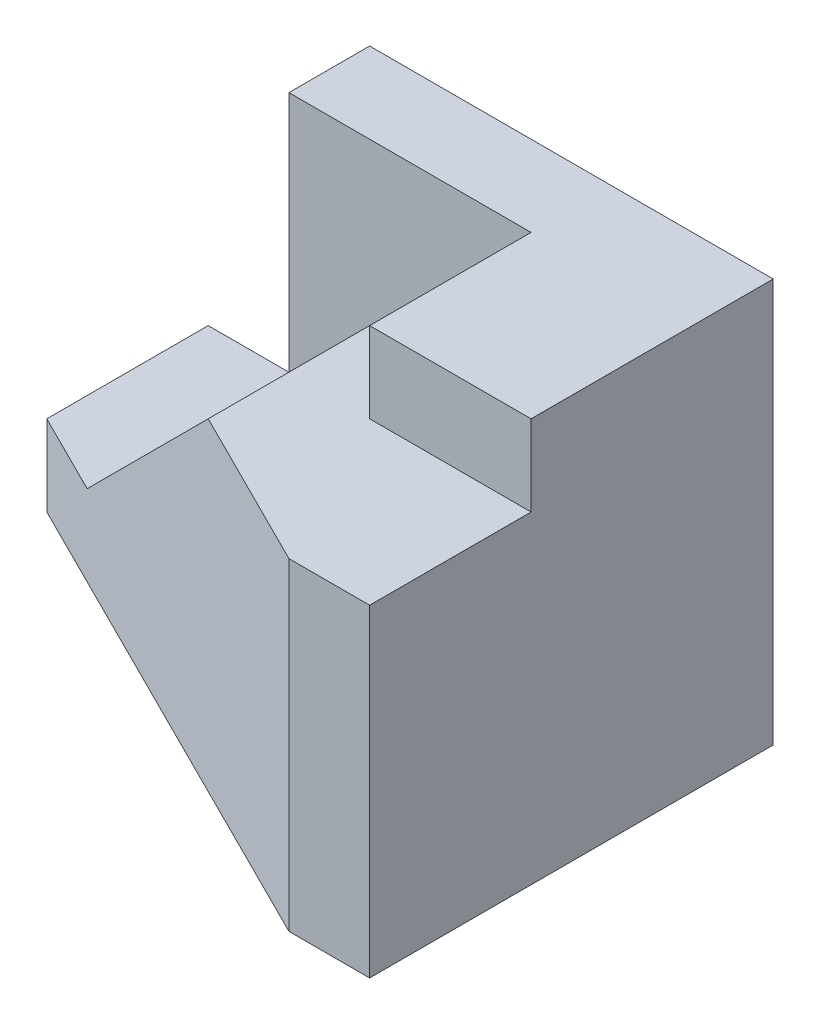
ISO-10303-21;
HEADER;
FILE_DESCRIPTION(('STEP AP214'),'2;1');
FILE_NAME('part.step','',(''),(''),'','','');
FILE_SCHEMA(('AUTOMOTIVE_DESIGN { 1 0 10303 214 1 1 1 1 }'));
ENDSEC;
DATA;
#1=APPLICATION_CONTEXT('core data for automotive mechanical design processes');
#2=APPLICATION_PROTOCOL_DEFINITION('international standard','automotive_design',2000,#1);
#3=PRODUCT_CONTEXT('',#1,'mechanical');
#4=PRODUCT('Part','Part','',(#3));
#5=PRODUCT_RELATED_PRODUCT_CATEGORY('part','',(#4));
#6=PRODUCT_DEFINITION_FORMATION('','',#4);
#7=PRODUCT_DEFINITION_CONTEXT('part definition',#1,'design');
#8=PRODUCT_DEFINITION('design','',#6,#7);
#9=PRODUCT_DEFINITION_SHAPE('','',#8);
#10=(LENGTH_UNIT() NAMED_UNIT(*) SI_UNIT(.MILLI.,.METRE.));
#11=(NAMED_UNIT(*) PLANE_ANGLE_UNIT() SI_UNIT($,.RADIAN.));
#12=(NAMED_UNIT(*) SI_UNIT($,.STERADIAN.) SOLID_ANGLE_UNIT());
#13=UNCERTAINTY_MEASURE_WITH_UNIT(LENGTH_MEASURE(1.E-05),#10,'distance_accuracy_value','');
#14=(GEOMETRIC_REPRESENTATION_CONTEXT(3) GLOBAL_UNCERTAINTY_ASSIGNED_CONTEXT((#13)) GLOBAL_UNIT_ASSIGNED_CONTEXT((#10,
#11,#12)) REPRESENTATION_CONTEXT('',''));
#15=CARTESIAN_POINT('',(0.,0.,0.));
#16=DIRECTION('',(0.,0.,1.));
#17=DIRECTION('',(1.,0.,0.));
#18=AXIS2_PLACEMENT_3D('',#15,#16,#17);
#19=CARTESIAN_POINT('',(20.,20.,0.));
#20=DIRECTION('',(1.,0.,0.));
#21=DIRECTION('',(0.,0.,-1.));
#22=AXIS2_PLACEMENT_3D('',#19,#20,#21);
#23=PLANE('',#22);
#24=DIRECTION('',(0.,0.,1.));
#25=VECTOR('',#24,1.);
#26=CARTESIAN_POINT('',(20.,20.,0.));
#27=LINE('',#26,#25);
#28=CARTESIAN_POINT('',(20.,20.,0.));
#29=VERTEX_POINT('',#28);
#30=CARTESIAN_POINT('',(20.,20.,10.));
#31=VERTEX_POINT('',#30);
#32=EDGE_CURVE('E134',#29,#31,#27,.T.);
#33=ORIENTED_EDGE('',*,*,#32,.T.);
#34=DIRECTION('',(0.,1.,0.));
#35=VECTOR('',#34,1.);
#36=CARTESIAN_POINT('',(20.,40.,10.));
#37=LINE('',#36,#35);
#38=CARTESIAN_POINT('',(20.,50.,10.));
#39=VERTEX_POINT('',#38);
#40=EDGE_CURVE('E121',#31,#39,#37,.T.);
#41=ORIENTED_EDGE('',*,*,#40,.T.);
#42=DIRECTION('',(0.,0.,1.));
#43=VECTOR('',#42,1.);
#44=CARTESIAN_POINT('',(20.,50.,0.));
#45=LINE('',#44,#43);
#46=CARTESIAN_POINT('',(20.,50.,0.));
#47=VERTEX_POINT('',#46);
#48=EDGE_CURVE('E142',#47,#39,#45,.T.);
#49=ORIENTED_EDGE('',*,*,#48,.F.);
#50=DIRECTION('',(0.,1.,0.));
#51=VECTOR('',#50,1.);
#52=CARTESIAN_POINT('',(20.,20.,0.));
#53=LINE('',#52,#51);
#54=EDGE_CURVE('E140',#29,#47,#53,.T.);
#55=ORIENTED_EDGE('',*,*,#54,.F.);
#56=EDGE_LOOP('',(#33,#41,#49,#55));
#57=FACE_BOUND('',#56,.T.);
#58=ADVANCED_FACE('F33',(#57),#23,.F.);
#59=CARTESIAN_POINT('',(0.,0.,50.));
#60=DIRECTION('',(1.,0.,0.));
#61=DIRECTION('',(0.,0.,-1.));
#62=AXIS2_PLACEMENT_3D('',#59,#60,#61);
#63=PLANE('',#62);
#64=DIRECTION('',(0.,0.,-1.));
#65=VECTOR('',#64,1.);
#66=CARTESIAN_POINT('',(0.,0.,50.));
#67=LINE('',#66,#65);
#68=CARTESIAN_POINT('',(0.,0.,20.));
#69=VERTEX_POINT('',#68);
#70=CARTESIAN_POINT('',(0.,0.,0.));
#71=VERTEX_POINT('',#70);
#72=EDGE_CURVE('E173',#69,#71,#67,.T.);
#73=ORIENTED_EDGE('',*,*,#72,.F.);
#74=DIRECTION('',(0.,-1.,0.));
#75=VECTOR('',#74,1.);
#76=CARTESIAN_POINT('',(0.,50.,20.));
#77=LINE('',#76,#75);
#78=CARTESIAN_POINT('',(0.,10.,20.));
#79=VERTEX_POINT('',#78);
#80=EDGE_CURVE('E188',#79,#69,#77,.T.);
#81=ORIENTED_EDGE('',*,*,#80,.F.);
#82=DIRECTION('',(0.,0.,1.));
#83=VECTOR('',#82,1.);
#84=CARTESIAN_POINT('',(0.,10.,0.));
#85=LINE('',#84,#83);
#86=CARTESIAN_POINT('',(0.,10.,0.));
#87=VERTEX_POINT('',#86);
#88=EDGE_CURVE('E147',#87,#79,#85,.T.);
#89=ORIENTED_EDGE('',*,*,#88,.F.);
#90=DIRECTION('',(0.,-1.,0.));
#91=VECTOR('',#90,1.);
#92=CARTESIAN_POINT('',(0.,0.,0.));
#93=LINE('',#92,#91);
#94=EDGE_CURVE('E145',#87,#71,#93,.T.);
#95=ORIENTED_EDGE('',*,*,#94,.T.);
#96=EDGE_LOOP('',(#73,#81,#89,#95));
#97=FACE_BOUND('',#96,.T.);
#98=ADVANCED_FACE('F35',(#97),#63,.F.);
#99=CARTESIAN_POINT('',(0.,0.,50.));
#100=DIRECTION('',(0.,1.,0.));
#101=DIRECTION('',(0.,0.,1.));
#102=AXIS2_PLACEMENT_3D('',#99,#100,#101);
#103=PLANE('',#102);
#104=DIRECTION('',(1.,0.,0.));
#105=VECTOR('',#104,1.);
#106=CARTESIAN_POINT('',(0.,0.,50.));
#107=LINE('',#106,#105);
#108=CARTESIAN_POINT('',(60.,0.,50.));
#109=VERTEX_POINT('',#108);
#110=CARTESIAN_POINT('',(70.,0.,50.));
#111=VERTEX_POINT('',#110);
#112=EDGE_CURVE('E153',#109,#111,#107,.T.);
#113=ORIENTED_EDGE('',*,*,#112,.F.);
#114=DIRECTION('',(0.894427190999916,0.,0.447213595499958));
#115=VECTOR('',#114,1.);
#116=CARTESIAN_POINT('',(0.,0.,20.));
#117=LINE('',#116,#115);
#118=EDGE_CURVE('E128',#69,#109,#117,.T.);
#119=ORIENTED_EDGE('',*,*,#118,.F.);
#120=ORIENTED_EDGE('',*,*,#72,.T.);
#121=DIRECTION('',(1.,0.,0.));
#122=VECTOR('',#121,1.);
#123=CARTESIAN_POINT('',(0.,0.,0.));
#124=LINE('',#123,#122);
#125=CARTESIAN_POINT('',(70.,0.,0.));
#126=VERTEX_POINT('',#125);
#127=EDGE_CURVE('E162',#71,#126,#124,.T.);
#128=ORIENTED_EDGE('',*,*,#127,.T.);
#129=DIRECTION('',(0.,0.,-1.));
#130=VECTOR('',#129,1.);
#131=CARTESIAN_POINT('',(70.,0.,50.));
#132=LINE('',#131,#130);
#133=EDGE_CURVE('E170',#111,#126,#132,.T.);
#134=ORIENTED_EDGE('',*,*,#133,.F.);
#135=EDGE_LOOP('',(#113,#119,#120,#128,#134));
#136=FACE_BOUND('',#135,.T.);
#137=ADVANCED_FACE('F232',(#136),#103,.F.);
#138=CARTESIAN_POINT('',(70.,0.,50.));
#139=DIRECTION('',(-1.,0.,0.));
#140=DIRECTION('',(0.,0.,1.));
#141=AXIS2_PLACEMENT_3D('',#138,#139,#140);
#142=PLANE('',#141);
#143=DIRECTION('',(0.,0.,-1.));
#144=VECTOR('',#143,1.);
#145=CARTESIAN_POINT('',(70.,50.,50.));
#146=LINE('',#145,#144);
#147=CARTESIAN_POINT('',(70.,50.,30.));
#148=VERTEX_POINT('',#147);
#149=CARTESIAN_POINT('',(70.,50.,0.));
#150=VERTEX_POINT('',#149);
#151=EDGE_CURVE('E159',#148,#150,#146,.T.);
#152=ORIENTED_EDGE('',*,*,#151,.F.);
#153=DIRECTION('',(0.,1.,0.));
#154=VECTOR('',#153,1.);
#155=CARTESIAN_POINT('',(70.,40.,30.));
#156=LINE('',#155,#154);
#157=CARTESIAN_POINT('',(70.,40.,30.));
#158=VERTEX_POINT('',#157);
#159=EDGE_CURVE('E193',#158,#148,#156,.T.);
#160=ORIENTED_EDGE('',*,*,#159,.F.);
#161=DIRECTION('',(0.,0.,-1.));
#162=VECTOR('',#161,1.);
#163=CARTESIAN_POINT('',(70.,40.,30.));
#164=LINE('',#163,#162);
#165=CARTESIAN_POINT('',(70.,40.,50.));
#166=VERTEX_POINT('',#165);
#167=EDGE_CURVE('E213',#166,#158,#164,.T.);
#168=ORIENTED_EDGE('',*,*,#167,.F.);
#169=DIRECTION('',(0.,1.,0.));
#170=VECTOR('',#169,1.);
#171=CARTESIAN_POINT('',(70.,0.,50.));
#172=LINE('',#171,#170);
#173=EDGE_CURVE('E155',#111,#166,#172,.T.);
#174=ORIENTED_EDGE('',*,*,#173,.F.);
#175=ORIENTED_EDGE('',*,*,#133,.T.);
#176=DIRECTION('',(0.,1.,0.));
#177=VECTOR('',#176,1.);
#178=CARTESIAN_POINT('',(70.,0.,0.));
#179=LINE('',#178,#177);
#180=EDGE_CURVE('E164',#126,#150,#179,.T.);
#181=ORIENTED_EDGE('',*,*,#180,.T.);
#182=EDGE_LOOP('',(#152,#160,#168,#174,#175,#181));
#183=FACE_BOUND('',#182,.T.);
#184=ADVANCED_FACE('F237',(#183),#142,.F.);
#185=CARTESIAN_POINT('',(0.,50.,50.));
#186=DIRECTION('',(0.,-1.,0.));
#187=DIRECTION('',(0.,0.,-1.));
#188=AXIS2_PLACEMENT_3D('',#185,#186,#187);
#189=PLANE('',#188);
#190=ORIENTED_EDGE('',*,*,#48,.T.);
#191=DIRECTION('',(-1.,0.,0.));
#192=VECTOR('',#191,1.);
#193=CARTESIAN_POINT('',(20.,50.,10.));
#194=LINE('',#193,#192);
#195=CARTESIAN_POINT('',(50.,50.,10.));
#196=VERTEX_POINT('',#195);
#197=EDGE_CURVE('E124',#196,#39,#194,.T.);
#198=ORIENTED_EDGE('',*,*,#197,.F.);
#199=DIRECTION('',(0.,0.,-1.));
#200=VECTOR('',#199,1.);
#201=CARTESIAN_POINT('',(50.,50.,10.));
#202=LINE('',#201,#200);
#203=CARTESIAN_POINT('',(50.,50.,30.));
#204=VERTEX_POINT('',#203);
#205=EDGE_CURVE('E201',#204,#196,#202,.T.);
#206=ORIENTED_EDGE('',*,*,#205,.F.);
#207=DIRECTION('',(-1.,0.,0.));
#208=VECTOR('',#207,1.);
#209=CARTESIAN_POINT('',(50.,50.,30.));
#210=LINE('',#209,#208);
#211=EDGE_CURVE('E137',#148,#204,#210,.T.);
#212=ORIENTED_EDGE('',*,*,#211,.F.);
#213=ORIENTED_EDGE('',*,*,#151,.T.);
#214=DIRECTION('',(-1.,0.,0.));
#215=VECTOR('',#214,1.);
#216=CARTESIAN_POINT('',(0.,50.,0.));
#217=LINE('',#216,#215);
#218=EDGE_CURVE('E156',#150,#47,#217,.T.);
#219=ORIENTED_EDGE('',*,*,#218,.T.);
#220=EDGE_LOOP('',(#190,#198,#206,#212,#213,#219));
#221=FACE_BOUND('',#220,.T.);
#222=ADVANCED_FACE('F247',(#221),#189,.F.);
#223=CARTESIAN_POINT('',(0.,0.,50.));
#224=DIRECTION('',(0.,0.,-1.));
#225=DIRECTION('',(-1.,0.,0.));
#226=AXIS2_PLACEMENT_3D('',#223,#224,#225);
#227=PLANE('',#226);
#228=ORIENTED_EDGE('',*,*,#173,.T.);
#229=DIRECTION('',(1.,0.,0.));
#230=VECTOR('',#229,1.);
#231=CARTESIAN_POINT('',(70.,40.,50.));
#232=LINE('',#231,#230);
#233=CARTESIAN_POINT('',(60.,40.,50.));
#234=VERTEX_POINT('',#233);
#235=EDGE_CURVE('E216',#234,#166,#232,.T.);
#236=ORIENTED_EDGE('',*,*,#235,.F.);
#237=DIRECTION('',(0.,-1.,0.));
#238=VECTOR('',#237,1.);
#239=CARTESIAN_POINT('',(60.,50.,50.));
#240=LINE('',#239,#238);
#241=EDGE_CURVE('E187',#234,#109,#240,.T.);
#242=ORIENTED_EDGE('',*,*,#241,.T.);
#243=ORIENTED_EDGE('',*,*,#112,.T.);
#244=EDGE_LOOP('',(#228,#236,#242,#243));
#245=FACE_BOUND('',#244,.T.);
#246=ADVANCED_FACE('F224',(#245),#227,.F.);
#247=CARTESIAN_POINT('',(0.,0.,0.));
#248=DIRECTION('',(0.,0.,-1.));
#249=DIRECTION('',(-1.,0.,0.));
#250=AXIS2_PLACEMENT_3D('',#247,#248,#249);
#251=PLANE('',#250);
#252=ORIENTED_EDGE('',*,*,#54,.T.);
#253=ORIENTED_EDGE('',*,*,#218,.F.);
#254=ORIENTED_EDGE('',*,*,#180,.F.);
#255=ORIENTED_EDGE('',*,*,#127,.F.);
#256=ORIENTED_EDGE('',*,*,#94,.F.);
#257=DIRECTION('',(1.,0.,0.));
#258=VECTOR('',#257,1.);
#259=CARTESIAN_POINT('',(0.,10.,0.));
#260=LINE('',#259,#258);
#261=CARTESIAN_POINT('',(10.,10.,0.));
#262=VERTEX_POINT('',#261);
#263=EDGE_CURVE('E182',#87,#262,#260,.T.);
#264=ORIENTED_EDGE('',*,*,#263,.T.);
#265=DIRECTION('',(0.707106781186548,0.707106781186548,0.));
#266=VECTOR('',#265,1.);
#267=CARTESIAN_POINT('',(10.,10.,0.));
#268=LINE('',#267,#266);
#269=EDGE_CURVE('E180',#262,#29,#268,.T.);
#270=ORIENTED_EDGE('',*,*,#269,.T.);
#271=EDGE_LOOP('',(#252,#253,#254,#255,#256,#264,#270));
#272=FACE_BOUND('',#271,.T.);
#273=ADVANCED_FACE('F249',(#272),#251,.T.);
#274=CARTESIAN_POINT('',(10.,10.,0.));
#275=DIRECTION('',(0.707106781186548,-0.707106781186548,0.));
#276=DIRECTION('',(0.707106781186548,0.707106781186548,0.));
#277=AXIS2_PLACEMENT_3D('',#274,#275,#276);
#278=PLANE('',#277);
#279=DIRECTION('',(0.,0.,1.));
#280=VECTOR('',#279,1.);
#281=CARTESIAN_POINT('',(10.,10.,0.));
#282=LINE('',#281,#280);
#283=CARTESIAN_POINT('',(10.,10.,25.));
#284=VERTEX_POINT('',#283);
#285=EDGE_CURVE('E143',#262,#284,#282,.T.);
#286=ORIENTED_EDGE('',*,*,#285,.T.);
#287=DIRECTION('',(0.666666666666667,0.666666666666667,0.333333333333333));
#288=VECTOR('',#287,1.);
#289=CARTESIAN_POINT('',(4.44444444444445,4.44444444444445,22.2222222222222));
#290=LINE('',#289,#288);
#291=CARTESIAN_POINT('',(40.,40.,40.));
#292=VERTEX_POINT('',#291);
#293=EDGE_CURVE('E56',#284,#292,#290,.T.);
#294=ORIENTED_EDGE('',*,*,#293,.T.);
#295=DIRECTION('',(0.,0.,1.));
#296=VECTOR('',#295,1.);
#297=CARTESIAN_POINT('',(40.,40.,0.));
#298=LINE('',#297,#296);
#299=CARTESIAN_POINT('',(40.,40.,10.));
#300=VERTEX_POINT('',#299);
#301=EDGE_CURVE('E11',#300,#292,#298,.T.);
#302=ORIENTED_EDGE('',*,*,#301,.F.);
#303=DIRECTION('',(-0.707106781186548,-0.707106781186548,0.));
#304=VECTOR('',#303,1.);
#305=CARTESIAN_POINT('',(0.,0.,10.));
#306=LINE('',#305,#304);
#307=EDGE_CURVE('E48',#300,#31,#306,.T.);
#308=ORIENTED_EDGE('',*,*,#307,.T.);
#309=ORIENTED_EDGE('',*,*,#32,.F.);
#310=ORIENTED_EDGE('',*,*,#269,.F.);
#311=EDGE_LOOP('',(#286,#294,#302,#308,#309,#310));
#312=FACE_BOUND('',#311,.T.);
#313=ADVANCED_FACE('F133',(#312),#278,.F.);
#314=CARTESIAN_POINT('',(0.,10.,0.));
#315=DIRECTION('',(0.,-1.,0.));
#316=DIRECTION('',(0.,0.,-1.));
#317=AXIS2_PLACEMENT_3D('',#314,#315,#316);
#318=PLANE('',#317);
#319=ORIENTED_EDGE('',*,*,#88,.T.);
#320=DIRECTION('',(0.894427190999916,0.,0.447213595499958));
#321=VECTOR('',#320,1.);
#322=CARTESIAN_POINT('',(-8.,10.,16.));
#323=LINE('',#322,#321);
#324=EDGE_CURVE('E41',#79,#284,#323,.T.);
#325=ORIENTED_EDGE('',*,*,#324,.T.);
#326=ORIENTED_EDGE('',*,*,#285,.F.);
#327=ORIENTED_EDGE('',*,*,#263,.F.);
#328=EDGE_LOOP('',(#319,#325,#326,#327));
#329=FACE_BOUND('',#328,.T.);
#330=ADVANCED_FACE('F176',(#329),#318,.F.);
#331=CARTESIAN_POINT('',(0.,50.,20.));
#332=DIRECTION('',(0.447213595499958,0.,-0.894427190999916));
#333=DIRECTION('',(-0.894427190999916,0.,-0.447213595499958));
#334=AXIS2_PLACEMENT_3D('',#331,#332,#333);
#335=PLANE('',#334);
#336=DIRECTION('',(0.894427190999916,0.,0.447213595499958));
#337=VECTOR('',#336,1.);
#338=CARTESIAN_POINT('',(60.,40.,50.));
#339=LINE('',#338,#337);
#340=EDGE_CURVE('E200',#292,#234,#339,.T.);
#341=ORIENTED_EDGE('',*,*,#340,.F.);
#342=ORIENTED_EDGE('',*,*,#293,.F.);
#343=ORIENTED_EDGE('',*,*,#324,.F.);
#344=ORIENTED_EDGE('',*,*,#80,.T.);
#345=ORIENTED_EDGE('',*,*,#118,.T.);
#346=ORIENTED_EDGE('',*,*,#241,.F.);
#347=EDGE_LOOP('',(#341,#342,#343,#344,#345,#346));
#348=FACE_BOUND('',#347,.T.);
#349=ADVANCED_FACE('F226',(#348),#335,.F.);
#350=CARTESIAN_POINT('',(20.,40.,10.));
#351=DIRECTION('',(0.,0.,-1.));
#352=DIRECTION('',(-1.,0.,0.));
#353=AXIS2_PLACEMENT_3D('',#350,#351,#352);
#354=PLANE('',#353);
#355=ORIENTED_EDGE('',*,*,#197,.T.);
#356=ORIENTED_EDGE('',*,*,#40,.F.);
#357=ORIENTED_EDGE('',*,*,#307,.F.);
#358=DIRECTION('',(-1.,0.,0.));
#359=VECTOR('',#358,1.);
#360=CARTESIAN_POINT('',(20.,40.,10.));
#361=LINE('',#360,#359);
#362=CARTESIAN_POINT('',(50.,40.,10.));
#363=VERTEX_POINT('',#362);
#364=EDGE_CURVE('E196',#363,#300,#361,.T.);
#365=ORIENTED_EDGE('',*,*,#364,.F.);
#366=DIRECTION('',(0.,1.,0.));
#367=VECTOR('',#366,1.);
#368=CARTESIAN_POINT('',(50.,40.,10.));
#369=LINE('',#368,#367);
#370=EDGE_CURVE('E129',#363,#196,#369,.T.);
#371=ORIENTED_EDGE('',*,*,#370,.T.);
#372=EDGE_LOOP('',(#355,#356,#357,#365,#371));
#373=FACE_BOUND('',#372,.T.);
#374=ADVANCED_FACE('F122',(#373),#354,.F.);
#375=CARTESIAN_POINT('',(50.,40.,10.));
#376=DIRECTION('',(1.,0.,0.));
#377=DIRECTION('',(0.,0.,-1.));
#378=AXIS2_PLACEMENT_3D('',#375,#376,#377);
#379=PLANE('',#378);
#380=ORIENTED_EDGE('',*,*,#205,.T.);
#381=ORIENTED_EDGE('',*,*,#370,.F.);
#382=DIRECTION('',(0.,0.,-1.));
#383=VECTOR('',#382,1.);
#384=CARTESIAN_POINT('',(50.,40.,10.));
#385=LINE('',#384,#383);
#386=CARTESIAN_POINT('',(50.,40.,30.));
#387=VERTEX_POINT('',#386);
#388=EDGE_CURVE('E207',#387,#363,#385,.T.);
#389=ORIENTED_EDGE('',*,*,#388,.F.);
#390=DIRECTION('',(0.,1.,0.));
#391=VECTOR('',#390,1.);
#392=CARTESIAN_POINT('',(50.,40.,30.));
#393=LINE('',#392,#391);
#394=EDGE_CURVE('E195',#387,#204,#393,.T.);
#395=ORIENTED_EDGE('',*,*,#394,.T.);
#396=EDGE_LOOP('',(#380,#381,#389,#395));
#397=FACE_BOUND('',#396,.T.);
#398=ADVANCED_FACE('F245',(#397),#379,.F.);
#399=CARTESIAN_POINT('',(50.,40.,30.));
#400=DIRECTION('',(0.,0.,-1.));
#401=DIRECTION('',(-1.,0.,0.));
#402=AXIS2_PLACEMENT_3D('',#399,#400,#401);
#403=PLANE('',#402);
#404=ORIENTED_EDGE('',*,*,#211,.T.);
#405=ORIENTED_EDGE('',*,*,#394,.F.);
#406=DIRECTION('',(-1.,0.,0.));
#407=VECTOR('',#406,1.);
#408=CARTESIAN_POINT('',(50.,40.,30.));
#409=LINE('',#408,#407);
#410=EDGE_CURVE('E210',#158,#387,#409,.T.);
#411=ORIENTED_EDGE('',*,*,#410,.F.);
#412=ORIENTED_EDGE('',*,*,#159,.T.);
#413=EDGE_LOOP('',(#404,#405,#411,#412));
#414=FACE_BOUND('',#413,.T.);
#415=ADVANCED_FACE('F241',(#414),#403,.F.);
#416=CARTESIAN_POINT('',(0.,40.,0.));
#417=DIRECTION('',(0.,-1.,0.));
#418=DIRECTION('',(0.,0.,-1.));
#419=AXIS2_PLACEMENT_3D('',#416,#417,#418);
#420=PLANE('',#419);
#421=ORIENTED_EDGE('',*,*,#364,.T.);
#422=ORIENTED_EDGE('',*,*,#301,.T.);
#423=ORIENTED_EDGE('',*,*,#340,.T.);
#424=ORIENTED_EDGE('',*,*,#235,.T.);
#425=ORIENTED_EDGE('',*,*,#167,.T.);
#426=ORIENTED_EDGE('',*,*,#410,.T.);
#427=ORIENTED_EDGE('',*,*,#388,.T.);
#428=EDGE_LOOP('',(#421,#422,#423,#424,#425,#426,#427));
#429=FACE_BOUND('',#428,.T.);
#430=ADVANCED_FACE('F220',(#429),#420,.F.);
#431=CLOSED_SHELL('',(#58,#98,#137,#184,#222,#246,#273,#313,#330,#349,#374,#398,#415,#430));
#432=MANIFOLD_SOLID_BREP('B2',#431);
#433=ADVANCED_BREP_SHAPE_REPRESENTATION('',(#18,#432),#14);
#434=SHAPE_DEFINITION_REPRESENTATION(#9,#433);
ENDSEC;
END-ISO-10303-21;
